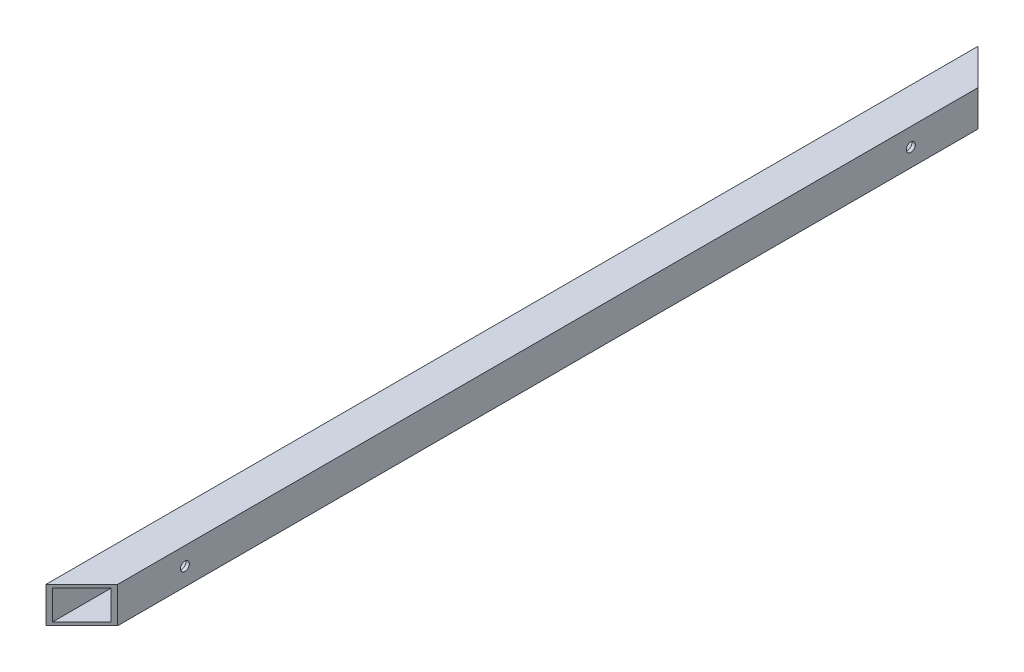
ISO-10303-21;
HEADER;
FILE_DESCRIPTION(('STEP AP214'),'2;1');
FILE_NAME('part.step','',(''),(''),'','','');
FILE_SCHEMA(('AUTOMOTIVE_DESIGN { 1 0 10303 214 1 1 1 1 }'));
ENDSEC;
DATA;
#1=APPLICATION_CONTEXT('core data for automotive mechanical design processes');
#2=APPLICATION_PROTOCOL_DEFINITION('international standard','automotive_design',2000,#1);
#3=PRODUCT_CONTEXT('',#1,'mechanical');
#4=PRODUCT('Part','Part','',(#3));
#5=PRODUCT_RELATED_PRODUCT_CATEGORY('part','',(#4));
#6=PRODUCT_DEFINITION_FORMATION('','',#4);
#7=PRODUCT_DEFINITION_CONTEXT('part definition',#1,'design');
#8=PRODUCT_DEFINITION('design','',#6,#7);
#9=PRODUCT_DEFINITION_SHAPE('','',#8);
#10=(LENGTH_UNIT() NAMED_UNIT(*) SI_UNIT(.MILLI.,.METRE.));
#11=(NAMED_UNIT(*) PLANE_ANGLE_UNIT() SI_UNIT($,.RADIAN.));
#12=(NAMED_UNIT(*) SI_UNIT($,.STERADIAN.) SOLID_ANGLE_UNIT());
#13=UNCERTAINTY_MEASURE_WITH_UNIT(LENGTH_MEASURE(1.E-05),#10,'distance_accuracy_value','');
#14=(GEOMETRIC_REPRESENTATION_CONTEXT(3) GLOBAL_UNCERTAINTY_ASSIGNED_CONTEXT((#13)) GLOBAL_UNIT_ASSIGNED_CONTEXT((#10,
#11,#12)) REPRESENTATION_CONTEXT('',''));
#15=CARTESIAN_POINT('',(0.,0.,0.));
#16=DIRECTION('',(0.,0.,1.));
#17=DIRECTION('',(1.,0.,0.));
#18=AXIS2_PLACEMENT_3D('',#15,#16,#17);
#19=CARTESIAN_POINT('',(-279.4,984.25,660.399999999999));
#20=DIRECTION('',(1.,0.,0.));
#21=DIRECTION('',(0.,0.,-1.));
#22=AXIS2_PLACEMENT_3D('',#19,#20,#21);
#23=PLANE('',#22);
#24=CARTESIAN_POINT('',(-279.4,958.85,-514.35));
#25=DIRECTION('',(-1.,0.,0.));
#26=DIRECTION('',(0.,0.,-1.));
#27=AXIS2_PLACEMENT_3D('',#24,#25,#26);
#28=CIRCLE('',#27,6.34999999999994);
#29=CARTESIAN_POINT('',(-279.4,958.85,-520.7));
#30=VERTEX_POINT('',#29);
#31=EDGE_CURVE('E310',#30,#30,#28,.T.);
#32=ORIENTED_EDGE('',*,*,#31,.F.);
#33=EDGE_LOOP('',(#32));
#34=FACE_BOUND('',#33,.T.);
#35=CARTESIAN_POINT('',(-279.4,958.85,514.35));
#36=DIRECTION('',(-1.,0.,0.));
#37=DIRECTION('',(0.,0.,1.));
#38=AXIS2_PLACEMENT_3D('',#35,#36,#37);
#39=CIRCLE('',#38,6.34999999999994);
#40=CARTESIAN_POINT('',(-279.4,958.85,520.7));
#41=VERTEX_POINT('',#40);
#42=EDGE_CURVE('E197',#41,#41,#39,.T.);
#43=ORIENTED_EDGE('',*,*,#42,.F.);
#44=EDGE_LOOP('',(#43));
#45=FACE_BOUND('',#44,.T.);
#46=DIRECTION('',(0.,-1.,0.));
#47=VECTOR('',#46,1.);
#48=CARTESIAN_POINT('',(-279.4,984.25,-660.399999999999));
#49=LINE('',#48,#47);
#50=CARTESIAN_POINT('',(-279.4,984.25,-660.399999999999));
#51=VERTEX_POINT('',#50);
#52=CARTESIAN_POINT('',(-279.4,933.45,-660.399999999999));
#53=VERTEX_POINT('',#52);
#54=EDGE_CURVE('E149',#51,#53,#49,.T.);
#55=ORIENTED_EDGE('',*,*,#54,.T.);
#56=DIRECTION('',(0.,0.,-1.));
#57=VECTOR('',#56,1.);
#58=CARTESIAN_POINT('',(-279.4,933.45,660.399999999999));
#59=LINE('',#58,#57);
#60=CARTESIAN_POINT('',(-279.4,933.45,660.399999999999));
#61=VERTEX_POINT('',#60);
#62=EDGE_CURVE('E174',#61,#53,#59,.T.);
#63=ORIENTED_EDGE('',*,*,#62,.F.);
#64=DIRECTION('',(0.,-1.,0.));
#65=VECTOR('',#64,1.);
#66=CARTESIAN_POINT('',(-279.4,984.25,660.399999999999));
#67=LINE('',#66,#65);
#68=CARTESIAN_POINT('',(-279.4,984.25,660.399999999999));
#69=VERTEX_POINT('',#68);
#70=EDGE_CURVE('E177',#69,#61,#67,.T.);
#71=ORIENTED_EDGE('',*,*,#70,.F.);
#72=DIRECTION('',(0.,0.,-1.));
#73=VECTOR('',#72,1.);
#74=CARTESIAN_POINT('',(-279.4,984.25,660.399999999999));
#75=LINE('',#74,#73);
#76=EDGE_CURVE('E169',#69,#51,#75,.T.);
#77=ORIENTED_EDGE('',*,*,#76,.T.);
#78=EDGE_LOOP('',(#55,#63,#71,#77));
#79=FACE_BOUND('',#78,.T.);
#80=ADVANCED_FACE('F62',(#34,#45,#79),#23,.F.);
#81=CARTESIAN_POINT('',(-279.4,933.45,660.399999999999));
#82=DIRECTION('',(0.,1.,0.));
#83=DIRECTION('',(0.,0.,1.));
#84=AXIS2_PLACEMENT_3D('',#81,#82,#83);
#85=PLANE('',#84);
#86=ORIENTED_EDGE('',*,*,#62,.T.);
#87=DIRECTION('',(-0.707106781186548,0.,-0.707106781186547));
#88=VECTOR('',#87,1.);
#89=CARTESIAN_POINT('',(-279.4,933.45,-660.399999999999));
#90=LINE('',#89,#88);
#91=CARTESIAN_POINT('',(-228.6,933.45,-609.599999999999));
#92=VERTEX_POINT('',#91);
#93=EDGE_CURVE('E155',#92,#53,#90,.T.);
#94=ORIENTED_EDGE('',*,*,#93,.F.);
#95=DIRECTION('',(0.,0.,-1.));
#96=VECTOR('',#95,1.);
#97=CARTESIAN_POINT('',(-228.6,933.45,660.399999999999));
#98=LINE('',#97,#96);
#99=CARTESIAN_POINT('',(-228.6,933.45,609.599999999999));
#100=VERTEX_POINT('',#99);
#101=EDGE_CURVE('E163',#100,#92,#98,.T.);
#102=ORIENTED_EDGE('',*,*,#101,.F.);
#103=DIRECTION('',(0.707106781186548,0.,-0.707106781186547));
#104=VECTOR('',#103,1.);
#105=CARTESIAN_POINT('',(-279.4,933.45,660.399999999999));
#106=LINE('',#105,#104);
#107=EDGE_CURVE('E218',#61,#100,#106,.T.);
#108=ORIENTED_EDGE('',*,*,#107,.F.);
#109=EDGE_LOOP('',(#86,#94,#102,#108));
#110=FACE_BOUND('',#109,.T.);
#111=ADVANCED_FACE('F256',(#110),#85,.F.);
#112=CARTESIAN_POINT('',(-228.6,984.25,660.399999999999));
#113=DIRECTION('',(-1.,0.,0.));
#114=DIRECTION('',(0.,0.,1.));
#115=AXIS2_PLACEMENT_3D('',#112,#113,#114);
#116=PLANE('',#115);
#117=CARTESIAN_POINT('',(-228.6,958.85,-514.35));
#118=DIRECTION('',(-1.,0.,0.));
#119=DIRECTION('',(0.,0.,-1.));
#120=AXIS2_PLACEMENT_3D('',#117,#118,#119);
#121=CIRCLE('',#120,6.34999999999994);
#122=CARTESIAN_POINT('',(-228.6,958.85,-520.7));
#123=VERTEX_POINT('',#122);
#124=EDGE_CURVE('E308',#123,#123,#121,.T.);
#125=ORIENTED_EDGE('',*,*,#124,.T.);
#126=EDGE_LOOP('',(#125));
#127=FACE_BOUND('',#126,.T.);
#128=CARTESIAN_POINT('',(-228.6,958.85,514.35));
#129=DIRECTION('',(-1.,0.,0.));
#130=DIRECTION('',(0.,0.,1.));
#131=AXIS2_PLACEMENT_3D('',#128,#129,#130);
#132=CIRCLE('',#131,6.34999999999994);
#133=CARTESIAN_POINT('',(-228.6,958.85,520.7));
#134=VERTEX_POINT('',#133);
#135=EDGE_CURVE('E189',#134,#134,#132,.T.);
#136=ORIENTED_EDGE('',*,*,#135,.T.);
#137=EDGE_LOOP('',(#136));
#138=FACE_BOUND('',#137,.T.);
#139=ORIENTED_EDGE('',*,*,#101,.T.);
#140=DIRECTION('',(0.,-1.,0.));
#141=VECTOR('',#140,1.);
#142=CARTESIAN_POINT('',(-228.6,984.25,-609.599999999999));
#143=LINE('',#142,#141);
#144=CARTESIAN_POINT('',(-228.6,984.25,-609.599999999999));
#145=VERTEX_POINT('',#144);
#146=EDGE_CURVE('E146',#145,#92,#143,.T.);
#147=ORIENTED_EDGE('',*,*,#146,.F.);
#148=DIRECTION('',(0.,0.,-1.));
#149=VECTOR('',#148,1.);
#150=CARTESIAN_POINT('',(-228.6,984.25,660.399999999999));
#151=LINE('',#150,#149);
#152=CARTESIAN_POINT('',(-228.6,984.25,609.599999999999));
#153=VERTEX_POINT('',#152);
#154=EDGE_CURVE('E161',#153,#145,#151,.T.);
#155=ORIENTED_EDGE('',*,*,#154,.F.);
#156=DIRECTION('',(0.,-1.,0.));
#157=VECTOR('',#156,1.);
#158=CARTESIAN_POINT('',(-228.6,984.25,609.599999999999));
#159=LINE('',#158,#157);
#160=EDGE_CURVE('E92',#153,#100,#159,.T.);
#161=ORIENTED_EDGE('',*,*,#160,.T.);
#162=EDGE_LOOP('',(#139,#147,#155,#161));
#163=FACE_BOUND('',#162,.T.);
#164=ADVANCED_FACE('F160',(#127,#138,#163),#116,.F.);
#165=CARTESIAN_POINT('',(-279.4,984.25,660.399999999999));
#166=DIRECTION('',(0.,-1.,0.));
#167=DIRECTION('',(0.,0.,-1.));
#168=AXIS2_PLACEMENT_3D('',#165,#166,#167);
#169=PLANE('',#168);
#170=ORIENTED_EDGE('',*,*,#154,.T.);
#171=DIRECTION('',(-0.707106781186548,0.,-0.707106781186547));
#172=VECTOR('',#171,1.);
#173=CARTESIAN_POINT('',(-279.4,984.25,-660.399999999999));
#174=LINE('',#173,#172);
#175=EDGE_CURVE('E143',#145,#51,#174,.T.);
#176=ORIENTED_EDGE('',*,*,#175,.T.);
#177=ORIENTED_EDGE('',*,*,#76,.F.);
#178=DIRECTION('',(0.707106781186548,0.,-0.707106781186547));
#179=VECTOR('',#178,1.);
#180=CARTESIAN_POINT('',(-279.4,984.25,660.399999999999));
#181=LINE('',#180,#179);
#182=EDGE_CURVE('E167',#69,#153,#181,.T.);
#183=ORIENTED_EDGE('',*,*,#182,.T.);
#184=EDGE_LOOP('',(#170,#176,#177,#183));
#185=FACE_BOUND('',#184,.T.);
#186=ADVANCED_FACE('F166',(#185),#169,.F.);
#187=CARTESIAN_POINT('',(-274.6375,984.25,660.399999999999));
#188=DIRECTION('',(1.,0.,0.));
#189=DIRECTION('',(0.,0.,-1.));
#190=AXIS2_PLACEMENT_3D('',#187,#188,#189);
#191=PLANE('',#190);
#192=CARTESIAN_POINT('',(-274.6375,958.85,-514.35));
#193=DIRECTION('',(1.,0.,0.));
#194=DIRECTION('',(0.,0.,-1.));
#195=AXIS2_PLACEMENT_3D('',#192,#193,#194);
#196=CIRCLE('',#195,6.34999999999994);
#197=CARTESIAN_POINT('',(-274.6375,958.85,-520.7));
#198=VERTEX_POINT('',#197);
#199=EDGE_CURVE('E203',#198,#198,#196,.T.);
#200=ORIENTED_EDGE('',*,*,#199,.F.);
#201=EDGE_LOOP('',(#200));
#202=FACE_BOUND('',#201,.T.);
#203=CARTESIAN_POINT('',(-274.6375,958.85,514.35));
#204=DIRECTION('',(1.,0.,0.));
#205=DIRECTION('',(0.,0.,-1.));
#206=AXIS2_PLACEMENT_3D('',#203,#204,#205);
#207=CIRCLE('',#206,6.34999999999994);
#208=CARTESIAN_POINT('',(-274.6375,958.85,508.));
#209=VERTEX_POINT('',#208);
#210=EDGE_CURVE('E188',#209,#209,#207,.T.);
#211=ORIENTED_EDGE('',*,*,#210,.F.);
#212=EDGE_LOOP('',(#211));
#213=FACE_BOUND('',#212,.T.);
#214=DIRECTION('',(0.,-1.,0.));
#215=VECTOR('',#214,1.);
#216=CARTESIAN_POINT('',(-274.6375,984.25,-655.637499999999));
#217=LINE('',#216,#215);
#218=CARTESIAN_POINT('',(-274.6375,979.4875,-655.637499999999));
#219=VERTEX_POINT('',#218);
#220=CARTESIAN_POINT('',(-274.6375,938.2125,-655.637499999999));
#221=VERTEX_POINT('',#220);
#222=EDGE_CURVE('E215',#219,#221,#217,.T.);
#223=ORIENTED_EDGE('',*,*,#222,.F.);
#224=DIRECTION('',(0.,0.,-1.));
#225=VECTOR('',#224,1.);
#226=CARTESIAN_POINT('',(-274.6375,979.4875,660.399999999999));
#227=LINE('',#226,#225);
#228=CARTESIAN_POINT('',(-274.6375,979.4875,655.637499999999));
#229=VERTEX_POINT('',#228);
#230=EDGE_CURVE('E234',#229,#219,#227,.T.);
#231=ORIENTED_EDGE('',*,*,#230,.F.);
#232=DIRECTION('',(0.,1.,0.));
#233=VECTOR('',#232,1.);
#234=CARTESIAN_POINT('',(-274.6375,984.25,655.637499999999));
#235=LINE('',#234,#233);
#236=CARTESIAN_POINT('',(-274.6375,938.2125,655.637499999999));
#237=VERTEX_POINT('',#236);
#238=EDGE_CURVE('E231',#237,#229,#235,.T.);
#239=ORIENTED_EDGE('',*,*,#238,.F.);
#240=DIRECTION('',(0.,0.,-1.));
#241=VECTOR('',#240,1.);
#242=CARTESIAN_POINT('',(-274.6375,938.2125,660.399999999999));
#243=LINE('',#242,#241);
#244=EDGE_CURVE('E244',#237,#221,#243,.T.);
#245=ORIENTED_EDGE('',*,*,#244,.T.);
#246=EDGE_LOOP('',(#223,#231,#239,#245));
#247=FACE_BOUND('',#246,.T.);
#248=ADVANCED_FACE('F268',(#202,#213,#247),#191,.T.);
#249=CARTESIAN_POINT('',(-279.4,938.2125,660.399999999999));
#250=DIRECTION('',(0.,1.,0.));
#251=DIRECTION('',(0.,0.,1.));
#252=AXIS2_PLACEMENT_3D('',#249,#250,#251);
#253=PLANE('',#252);
#254=DIRECTION('',(0.707106781186548,0.,0.707106781186547));
#255=VECTOR('',#254,1.);
#256=CARTESIAN_POINT('',(380.999999999999,938.2125,-5.55111512312578E-13));
#257=LINE('',#256,#255);
#258=CARTESIAN_POINT('',(-233.3625,938.2125,-614.362499999999));
#259=VERTEX_POINT('',#258);
#260=EDGE_CURVE('E212',#221,#259,#257,.T.);
#261=ORIENTED_EDGE('',*,*,#260,.F.);
#262=ORIENTED_EDGE('',*,*,#244,.F.);
#263=DIRECTION('',(-0.707106781186548,0.,0.707106781186547));
#264=VECTOR('',#263,1.);
#265=CARTESIAN_POINT('',(-279.4,938.2125,660.399999999999));
#266=LINE('',#265,#264);
#267=CARTESIAN_POINT('',(-233.3625,938.2125,614.362499999999));
#268=VERTEX_POINT('',#267);
#269=EDGE_CURVE('E228',#268,#237,#266,.T.);
#270=ORIENTED_EDGE('',*,*,#269,.F.);
#271=DIRECTION('',(0.,0.,-1.));
#272=VECTOR('',#271,1.);
#273=CARTESIAN_POINT('',(-233.3625,938.2125,660.399999999999));
#274=LINE('',#273,#272);
#275=EDGE_CURVE('E240',#268,#259,#274,.T.);
#276=ORIENTED_EDGE('',*,*,#275,.T.);
#277=EDGE_LOOP('',(#261,#262,#270,#276));
#278=FACE_BOUND('',#277,.T.);
#279=ADVANCED_FACE('F271',(#278),#253,.T.);
#280=CARTESIAN_POINT('',(-233.3625,984.25,660.399999999999));
#281=DIRECTION('',(-1.,0.,0.));
#282=DIRECTION('',(0.,0.,1.));
#283=AXIS2_PLACEMENT_3D('',#280,#281,#282);
#284=PLANE('',#283);
#285=CARTESIAN_POINT('',(-233.3625,958.85,-514.35));
#286=DIRECTION('',(-1.,0.,0.));
#287=DIRECTION('',(0.,0.,1.));
#288=AXIS2_PLACEMENT_3D('',#285,#286,#287);
#289=CIRCLE('',#288,6.34999999999994);
#290=CARTESIAN_POINT('',(-233.3625,958.85,-508.));
#291=VERTEX_POINT('',#290);
#292=EDGE_CURVE('E65',#291,#291,#289,.T.);
#293=ORIENTED_EDGE('',*,*,#292,.F.);
#294=EDGE_LOOP('',(#293));
#295=FACE_BOUND('',#294,.T.);
#296=CARTESIAN_POINT('',(-233.3625,958.85,514.35));
#297=DIRECTION('',(-1.,0.,0.));
#298=DIRECTION('',(0.,0.,1.));
#299=AXIS2_PLACEMENT_3D('',#296,#297,#298);
#300=CIRCLE('',#299,6.34999999999994);
#301=CARTESIAN_POINT('',(-233.3625,958.85,520.7));
#302=VERTEX_POINT('',#301);
#303=EDGE_CURVE('E185',#302,#302,#300,.T.);
#304=ORIENTED_EDGE('',*,*,#303,.F.);
#305=EDGE_LOOP('',(#304));
#306=FACE_BOUND('',#305,.T.);
#307=DIRECTION('',(0.,1.,0.));
#308=VECTOR('',#307,1.);
#309=CARTESIAN_POINT('',(-233.3625,984.25,-614.362499999999));
#310=LINE('',#309,#308);
#311=CARTESIAN_POINT('',(-233.3625,979.4875,-614.362499999999));
#312=VERTEX_POINT('',#311);
#313=EDGE_CURVE('E81',#259,#312,#310,.T.);
#314=ORIENTED_EDGE('',*,*,#313,.F.);
#315=ORIENTED_EDGE('',*,*,#275,.F.);
#316=DIRECTION('',(0.,-1.,0.));
#317=VECTOR('',#316,1.);
#318=CARTESIAN_POINT('',(-233.3625,984.25,614.362499999999));
#319=LINE('',#318,#317);
#320=CARTESIAN_POINT('',(-233.3625,979.4875,614.362499999999));
#321=VERTEX_POINT('',#320);
#322=EDGE_CURVE('E225',#321,#268,#319,.T.);
#323=ORIENTED_EDGE('',*,*,#322,.F.);
#324=DIRECTION('',(0.,0.,-1.));
#325=VECTOR('',#324,1.);
#326=CARTESIAN_POINT('',(-233.3625,979.4875,660.399999999999));
#327=LINE('',#326,#325);
#328=EDGE_CURVE('E237',#321,#312,#327,.T.);
#329=ORIENTED_EDGE('',*,*,#328,.T.);
#330=EDGE_LOOP('',(#314,#315,#323,#329));
#331=FACE_BOUND('',#330,.T.);
#332=ADVANCED_FACE('F275',(#295,#306,#331),#284,.T.);
#333=CARTESIAN_POINT('',(-279.4,979.4875,660.399999999999));
#334=DIRECTION('',(0.,-1.,0.));
#335=DIRECTION('',(0.,0.,-1.));
#336=AXIS2_PLACEMENT_3D('',#333,#334,#335);
#337=PLANE('',#336);
#338=DIRECTION('',(-0.707106781186548,0.,-0.707106781186547));
#339=VECTOR('',#338,1.);
#340=CARTESIAN_POINT('',(380.999999999999,979.4875,-5.55111512312578E-13));
#341=LINE('',#340,#339);
#342=EDGE_CURVE('E12',#312,#219,#341,.T.);
#343=ORIENTED_EDGE('',*,*,#342,.F.);
#344=ORIENTED_EDGE('',*,*,#328,.F.);
#345=DIRECTION('',(0.707106781186548,0.,-0.707106781186547));
#346=VECTOR('',#345,1.);
#347=CARTESIAN_POINT('',(-279.4,979.4875,660.399999999999));
#348=LINE('',#347,#346);
#349=EDGE_CURVE('E71',#229,#321,#348,.T.);
#350=ORIENTED_EDGE('',*,*,#349,.F.);
#351=ORIENTED_EDGE('',*,*,#230,.T.);
#352=EDGE_LOOP('',(#343,#344,#350,#351));
#353=FACE_BOUND('',#352,.T.);
#354=ADVANCED_FACE('F279',(#353),#337,.T.);
#355=CARTESIAN_POINT('',(-279.4,984.25,660.399999999999));
#356=DIRECTION('',(-0.707106781186547,0.,-0.707106781186548));
#357=DIRECTION('',(-0.707106781186548,0.,0.707106781186547));
#358=AXIS2_PLACEMENT_3D('',#355,#356,#357);
#359=PLANE('',#358);
#360=ORIENTED_EDGE('',*,*,#238,.T.);
#361=ORIENTED_EDGE('',*,*,#349,.T.);
#362=ORIENTED_EDGE('',*,*,#322,.T.);
#363=ORIENTED_EDGE('',*,*,#269,.T.);
#364=EDGE_LOOP('',(#360,#361,#362,#363));
#365=FACE_BOUND('',#364,.T.);
#366=ORIENTED_EDGE('',*,*,#107,.T.);
#367=ORIENTED_EDGE('',*,*,#160,.F.);
#368=ORIENTED_EDGE('',*,*,#182,.F.);
#369=ORIENTED_EDGE('',*,*,#70,.T.);
#370=EDGE_LOOP('',(#366,#367,#368,#369));
#371=FACE_BOUND('',#370,.T.);
#372=ADVANCED_FACE('F254',(#365,#371),#359,.F.);
#373=CARTESIAN_POINT('',(-279.4,984.25,-660.399999999999));
#374=DIRECTION('',(-0.707106781186547,0.,0.707106781186548));
#375=DIRECTION('',(0.707106781186548,0.,0.707106781186547));
#376=AXIS2_PLACEMENT_3D('',#373,#374,#375);
#377=PLANE('',#376);
#378=ORIENTED_EDGE('',*,*,#222,.T.);
#379=ORIENTED_EDGE('',*,*,#260,.T.);
#380=ORIENTED_EDGE('',*,*,#313,.T.);
#381=ORIENTED_EDGE('',*,*,#342,.T.);
#382=EDGE_LOOP('',(#378,#379,#380,#381));
#383=FACE_BOUND('',#382,.T.);
#384=ORIENTED_EDGE('',*,*,#93,.T.);
#385=ORIENTED_EDGE('',*,*,#54,.F.);
#386=ORIENTED_EDGE('',*,*,#175,.F.);
#387=ORIENTED_EDGE('',*,*,#146,.T.);
#388=EDGE_LOOP('',(#384,#385,#386,#387));
#389=FACE_BOUND('',#388,.T.);
#390=ADVANCED_FACE('F145',(#383,#389),#377,.F.);
#391=CARTESIAN_POINT('',(-228.6,958.85,514.35));
#392=DIRECTION('',(-1.,0.,0.));
#393=DIRECTION('',(0.,0.,1.));
#394=AXIS2_PLACEMENT_3D('',#391,#392,#393);
#395=CYLINDRICAL_SURFACE('',#394,6.34999999999994);
#396=ORIENTED_EDGE('',*,*,#303,.T.);
#397=EDGE_LOOP('',(#396));
#398=FACE_BOUND('',#397,.T.);
#399=ORIENTED_EDGE('',*,*,#135,.F.);
#400=EDGE_LOOP('',(#399));
#401=FACE_BOUND('',#400,.T.);
#402=ADVANCED_FACE('F289',(#398,#401),#395,.F.);
#403=ORIENTED_EDGE('',*,*,#210,.T.);
#404=EDGE_LOOP('',(#403));
#405=FACE_BOUND('',#404,.T.);
#406=ORIENTED_EDGE('',*,*,#42,.T.);
#407=EDGE_LOOP('',(#406));
#408=FACE_BOUND('',#407,.T.);
#409=ADVANCED_FACE('F292',(#405,#408),#395,.F.);
#410=CARTESIAN_POINT('',(-228.6,958.85,-514.35));
#411=DIRECTION('',(-1.,0.,0.));
#412=DIRECTION('',(0.,0.,1.));
#413=AXIS2_PLACEMENT_3D('',#410,#411,#412);
#414=CYLINDRICAL_SURFACE('',#413,6.34999999999994);
#415=ORIENTED_EDGE('',*,*,#292,.T.);
#416=EDGE_LOOP('',(#415));
#417=FACE_BOUND('',#416,.T.);
#418=ORIENTED_EDGE('',*,*,#124,.F.);
#419=EDGE_LOOP('',(#418));
#420=FACE_BOUND('',#419,.T.);
#421=ADVANCED_FACE('F293',(#417,#420),#414,.F.);
#422=ORIENTED_EDGE('',*,*,#199,.T.);
#423=EDGE_LOOP('',(#422));
#424=FACE_BOUND('',#423,.T.);
#425=ORIENTED_EDGE('',*,*,#31,.T.);
#426=EDGE_LOOP('',(#425));
#427=FACE_BOUND('',#426,.T.);
#428=ADVANCED_FACE('F295',(#424,#427),#414,.F.);
#429=CLOSED_SHELL('',(#80,#111,#164,#186,#248,#279,#332,#354,#372,#390,#402,#409,#421,#428));
#430=MANIFOLD_SOLID_BREP('B2',#429);
#431=ADVANCED_BREP_SHAPE_REPRESENTATION('',(#18,#430),#14);
#432=SHAPE_DEFINITION_REPRESENTATION(#9,#431);
ENDSEC;
END-ISO-10303-21;
